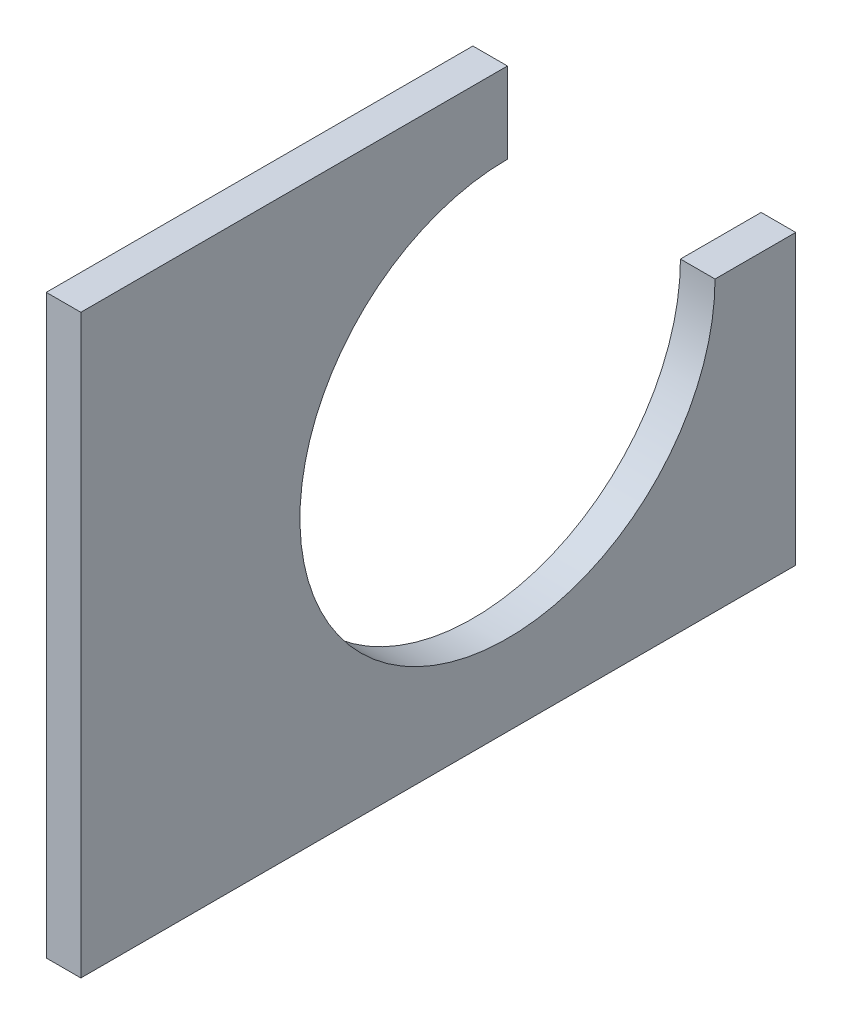
ISO-10303-21;
HEADER;
FILE_DESCRIPTION(('STEP AP214'),'2;1');
FILE_NAME('part.step','',(''),(''),'','','');
FILE_SCHEMA(('AUTOMOTIVE_DESIGN { 1 0 10303 214 1 1 1 1 }'));
ENDSEC;
DATA;
#1=APPLICATION_CONTEXT('core data for automotive mechanical design processes');
#2=APPLICATION_PROTOCOL_DEFINITION('international standard','automotive_design',2000,#1);
#3=PRODUCT_CONTEXT('',#1,'mechanical');
#4=PRODUCT('Part','Part','',(#3));
#5=PRODUCT_RELATED_PRODUCT_CATEGORY('part','',(#4));
#6=PRODUCT_DEFINITION_FORMATION('','',#4);
#7=PRODUCT_DEFINITION_CONTEXT('part definition',#1,'design');
#8=PRODUCT_DEFINITION('design','',#6,#7);
#9=PRODUCT_DEFINITION_SHAPE('','',#8);
#10=(LENGTH_UNIT() NAMED_UNIT(*) SI_UNIT(.MILLI.,.METRE.));
#11=(NAMED_UNIT(*) PLANE_ANGLE_UNIT() SI_UNIT($,.RADIAN.));
#12=(NAMED_UNIT(*) SI_UNIT($,.STERADIAN.) SOLID_ANGLE_UNIT());
#13=UNCERTAINTY_MEASURE_WITH_UNIT(LENGTH_MEASURE(1.E-05),#10,'distance_accuracy_value','');
#14=(GEOMETRIC_REPRESENTATION_CONTEXT(3) GLOBAL_UNCERTAINTY_ASSIGNED_CONTEXT((#13)) GLOBAL_UNIT_ASSIGNED_CONTEXT((#10,
#11,#12)) REPRESENTATION_CONTEXT('',''));
#15=CARTESIAN_POINT('',(0.,0.,0.));
#16=DIRECTION('',(0.,0.,1.));
#17=DIRECTION('',(1.,0.,0.));
#18=AXIS2_PLACEMENT_3D('',#15,#16,#17);
#19=CARTESIAN_POINT('',(3.,0.,0.));
#20=DIRECTION('',(-1.,0.,0.));
#21=DIRECTION('',(0.,0.,1.));
#22=AXIS2_PLACEMENT_3D('',#19,#20,#21);
#23=CYLINDRICAL_SURFACE('',#22,18.);
#24=CARTESIAN_POINT('',(0.,0.,0.));
#25=DIRECTION('',(-1.,0.,0.));
#26=DIRECTION('',(0.,0.,-1.));
#27=AXIS2_PLACEMENT_3D('',#24,#25,#26);
#28=CIRCLE('',#27,18.);
#29=CARTESIAN_POINT('',(0.,0.,-18.));
#30=VERTEX_POINT('',#29);
#31=CARTESIAN_POINT('',(0.,18.,0.));
#32=VERTEX_POINT('',#31);
#33=EDGE_CURVE('E123',#30,#32,#28,.T.);
#34=ORIENTED_EDGE('',*,*,#33,.T.);
#35=DIRECTION('',(-1.,0.,0.));
#36=VECTOR('',#35,1.);
#37=CARTESIAN_POINT('',(3.,18.,0.));
#38=LINE('',#37,#36);
#39=CARTESIAN_POINT('',(3.,18.,0.));
#40=VERTEX_POINT('',#39);
#41=EDGE_CURVE('E11',#40,#32,#38,.T.);
#42=ORIENTED_EDGE('',*,*,#41,.F.);
#43=CARTESIAN_POINT('',(3.,0.,0.));
#44=DIRECTION('',(-1.,0.,0.));
#45=DIRECTION('',(0.,0.,-1.));
#46=AXIS2_PLACEMENT_3D('',#43,#44,#45);
#47=CIRCLE('',#46,18.);
#48=CARTESIAN_POINT('',(3.,0.,-18.));
#49=VERTEX_POINT('',#48);
#50=EDGE_CURVE('E135',#49,#40,#47,.T.);
#51=ORIENTED_EDGE('',*,*,#50,.F.);
#52=DIRECTION('',(-1.,0.,0.));
#53=VECTOR('',#52,1.);
#54=CARTESIAN_POINT('',(3.,0.,-18.));
#55=LINE('',#54,#53);
#56=EDGE_CURVE('E119',#49,#30,#55,.T.);
#57=ORIENTED_EDGE('',*,*,#56,.T.);
#58=EDGE_LOOP('',(#34,#42,#51,#57));
#59=FACE_BOUND('',#58,.T.);
#60=ADVANCED_FACE('F33',(#59),#23,.F.);
#61=CARTESIAN_POINT('',(3.,25.,0.));
#62=DIRECTION('',(0.,0.,1.));
#63=DIRECTION('',(0.,-1.,0.));
#64=AXIS2_PLACEMENT_3D('',#61,#62,#63);
#65=PLANE('',#64);
#66=DIRECTION('',(0.,1.,0.));
#67=VECTOR('',#66,1.);
#68=CARTESIAN_POINT('',(0.,25.,0.));
#69=LINE('',#68,#67);
#70=CARTESIAN_POINT('',(0.,25.,0.));
#71=VERTEX_POINT('',#70);
#72=EDGE_CURVE('E126',#32,#71,#69,.T.);
#73=ORIENTED_EDGE('',*,*,#72,.T.);
#74=DIRECTION('',(-1.,0.,0.));
#75=VECTOR('',#74,1.);
#76=CARTESIAN_POINT('',(3.,25.,0.));
#77=LINE('',#76,#75);
#78=CARTESIAN_POINT('',(3.,25.,0.));
#79=VERTEX_POINT('',#78);
#80=EDGE_CURVE('E41',#79,#71,#77,.T.);
#81=ORIENTED_EDGE('',*,*,#80,.F.);
#82=DIRECTION('',(0.,1.,0.));
#83=VECTOR('',#82,1.);
#84=CARTESIAN_POINT('',(3.,25.,0.));
#85=LINE('',#84,#83);
#86=EDGE_CURVE('E89',#40,#79,#85,.T.);
#87=ORIENTED_EDGE('',*,*,#86,.F.);
#88=ORIENTED_EDGE('',*,*,#41,.T.);
#89=EDGE_LOOP('',(#73,#81,#87,#88));
#90=FACE_BOUND('',#89,.T.);
#91=ADVANCED_FACE('F160',(#90),#65,.F.);
#92=CARTESIAN_POINT('',(3.,25.,37.));
#93=DIRECTION('',(0.,-1.,0.));
#94=DIRECTION('',(0.,0.,-1.));
#95=AXIS2_PLACEMENT_3D('',#92,#93,#94);
#96=PLANE('',#95);
#97=DIRECTION('',(0.,0.,1.));
#98=VECTOR('',#97,1.);
#99=CARTESIAN_POINT('',(0.,25.,37.));
#100=LINE('',#99,#98);
#101=CARTESIAN_POINT('',(0.,25.,37.));
#102=VERTEX_POINT('',#101);
#103=EDGE_CURVE('E128',#71,#102,#100,.T.);
#104=ORIENTED_EDGE('',*,*,#103,.T.);
#105=DIRECTION('',(-1.,0.,0.));
#106=VECTOR('',#105,1.);
#107=CARTESIAN_POINT('',(3.,25.,37.));
#108=LINE('',#107,#106);
#109=CARTESIAN_POINT('',(3.,25.,37.));
#110=VERTEX_POINT('',#109);
#111=EDGE_CURVE('E139',#110,#102,#108,.T.);
#112=ORIENTED_EDGE('',*,*,#111,.F.);
#113=DIRECTION('',(0.,0.,1.));
#114=VECTOR('',#113,1.);
#115=CARTESIAN_POINT('',(3.,25.,37.));
#116=LINE('',#115,#114);
#117=EDGE_CURVE('E147',#79,#110,#116,.T.);
#118=ORIENTED_EDGE('',*,*,#117,.F.);
#119=ORIENTED_EDGE('',*,*,#80,.T.);
#120=EDGE_LOOP('',(#104,#112,#118,#119));
#121=FACE_BOUND('',#120,.T.);
#122=ADVANCED_FACE('F145',(#121),#96,.F.);
#123=CARTESIAN_POINT('',(3.,25.,37.));
#124=DIRECTION('',(0.,0.,-1.));
#125=DIRECTION('',(-1.,0.,0.));
#126=AXIS2_PLACEMENT_3D('',#123,#124,#125);
#127=PLANE('',#126);
#128=DIRECTION('',(0.,-1.,0.));
#129=VECTOR('',#128,1.);
#130=CARTESIAN_POINT('',(0.,25.,37.));
#131=LINE('',#130,#129);
#132=CARTESIAN_POINT('',(0.,-25.,37.));
#133=VERTEX_POINT('',#132);
#134=EDGE_CURVE('E130',#102,#133,#131,.T.);
#135=ORIENTED_EDGE('',*,*,#134,.T.);
#136=DIRECTION('',(-1.,0.,0.));
#137=VECTOR('',#136,1.);
#138=CARTESIAN_POINT('',(3.,-25.,37.));
#139=LINE('',#138,#137);
#140=CARTESIAN_POINT('',(3.,-25.,37.));
#141=VERTEX_POINT('',#140);
#142=EDGE_CURVE('E114',#141,#133,#139,.T.);
#143=ORIENTED_EDGE('',*,*,#142,.F.);
#144=DIRECTION('',(0.,-1.,0.));
#145=VECTOR('',#144,1.);
#146=CARTESIAN_POINT('',(3.,25.,37.));
#147=LINE('',#146,#145);
#148=EDGE_CURVE('E105',#110,#141,#147,.T.);
#149=ORIENTED_EDGE('',*,*,#148,.F.);
#150=ORIENTED_EDGE('',*,*,#111,.T.);
#151=EDGE_LOOP('',(#135,#143,#149,#150));
#152=FACE_BOUND('',#151,.T.);
#153=ADVANCED_FACE('F153',(#152),#127,.F.);
#154=CARTESIAN_POINT('',(3.,-25.,37.));
#155=DIRECTION('',(0.,1.,0.));
#156=DIRECTION('',(0.,0.,1.));
#157=AXIS2_PLACEMENT_3D('',#154,#155,#156);
#158=PLANE('',#157);
#159=DIRECTION('',(0.,0.,-1.));
#160=VECTOR('',#159,1.);
#161=CARTESIAN_POINT('',(0.,-25.,37.));
#162=LINE('',#161,#160);
#163=CARTESIAN_POINT('',(0.,-25.,-25.));
#164=VERTEX_POINT('',#163);
#165=EDGE_CURVE('E113',#133,#164,#162,.T.);
#166=ORIENTED_EDGE('',*,*,#165,.T.);
#167=DIRECTION('',(-1.,0.,0.));
#168=VECTOR('',#167,1.);
#169=CARTESIAN_POINT('',(3.,-25.,-25.));
#170=LINE('',#169,#168);
#171=CARTESIAN_POINT('',(3.,-25.,-25.));
#172=VERTEX_POINT('',#171);
#173=EDGE_CURVE('E110',#172,#164,#170,.T.);
#174=ORIENTED_EDGE('',*,*,#173,.F.);
#175=DIRECTION('',(0.,0.,-1.));
#176=VECTOR('',#175,1.);
#177=CARTESIAN_POINT('',(3.,-25.,37.));
#178=LINE('',#177,#176);
#179=EDGE_CURVE('E99',#141,#172,#178,.T.);
#180=ORIENTED_EDGE('',*,*,#179,.F.);
#181=ORIENTED_EDGE('',*,*,#142,.T.);
#182=EDGE_LOOP('',(#166,#174,#180,#181));
#183=FACE_BOUND('',#182,.T.);
#184=ADVANCED_FACE('F111',(#183),#158,.F.);
#185=CARTESIAN_POINT('',(3.,0.,-25.));
#186=DIRECTION('',(0.,0.,1.));
#187=DIRECTION('',(0.,-1.,0.));
#188=AXIS2_PLACEMENT_3D('',#185,#186,#187);
#189=PLANE('',#188);
#190=DIRECTION('',(0.,1.,0.));
#191=VECTOR('',#190,1.);
#192=CARTESIAN_POINT('',(0.,0.,-25.));
#193=LINE('',#192,#191);
#194=CARTESIAN_POINT('',(0.,0.,-25.));
#195=VERTEX_POINT('',#194);
#196=EDGE_CURVE('E75',#164,#195,#193,.T.);
#197=ORIENTED_EDGE('',*,*,#196,.T.);
#198=DIRECTION('',(-1.,0.,0.));
#199=VECTOR('',#198,1.);
#200=CARTESIAN_POINT('',(3.,0.,-25.));
#201=LINE('',#200,#199);
#202=CARTESIAN_POINT('',(3.,0.,-25.));
#203=VERTEX_POINT('',#202);
#204=EDGE_CURVE('E115',#203,#195,#201,.T.);
#205=ORIENTED_EDGE('',*,*,#204,.F.);
#206=DIRECTION('',(0.,1.,0.));
#207=VECTOR('',#206,1.);
#208=CARTESIAN_POINT('',(3.,0.,-25.));
#209=LINE('',#208,#207);
#210=EDGE_CURVE('E103',#172,#203,#209,.T.);
#211=ORIENTED_EDGE('',*,*,#210,.F.);
#212=ORIENTED_EDGE('',*,*,#173,.T.);
#213=EDGE_LOOP('',(#197,#205,#211,#212));
#214=FACE_BOUND('',#213,.T.);
#215=ADVANCED_FACE('F117',(#214),#189,.F.);
#216=CARTESIAN_POINT('',(3.,0.,-18.));
#217=DIRECTION('',(0.,-1.,0.));
#218=DIRECTION('',(0.,0.,-1.));
#219=AXIS2_PLACEMENT_3D('',#216,#217,#218);
#220=PLANE('',#219);
#221=DIRECTION('',(0.,0.,1.));
#222=VECTOR('',#221,1.);
#223=CARTESIAN_POINT('',(0.,0.,-18.));
#224=LINE('',#223,#222);
#225=EDGE_CURVE('E81',#195,#30,#224,.T.);
#226=ORIENTED_EDGE('',*,*,#225,.T.);
#227=ORIENTED_EDGE('',*,*,#56,.F.);
#228=DIRECTION('',(0.,0.,1.));
#229=VECTOR('',#228,1.);
#230=CARTESIAN_POINT('',(3.,0.,-18.));
#231=LINE('',#230,#229);
#232=EDGE_CURVE('E49',#203,#49,#231,.T.);
#233=ORIENTED_EDGE('',*,*,#232,.F.);
#234=ORIENTED_EDGE('',*,*,#204,.T.);
#235=EDGE_LOOP('',(#226,#227,#233,#234));
#236=FACE_BOUND('',#235,.T.);
#237=ADVANCED_FACE('F174',(#236),#220,.F.);
#238=CARTESIAN_POINT('',(3.,0.,0.));
#239=DIRECTION('',(1.,0.,0.));
#240=DIRECTION('',(0.,0.,-1.));
#241=AXIS2_PLACEMENT_3D('',#238,#239,#240);
#242=PLANE('',#241);
#243=ORIENTED_EDGE('',*,*,#50,.T.);
#244=ORIENTED_EDGE('',*,*,#86,.T.);
#245=ORIENTED_EDGE('',*,*,#117,.T.);
#246=ORIENTED_EDGE('',*,*,#148,.T.);
#247=ORIENTED_EDGE('',*,*,#179,.T.);
#248=ORIENTED_EDGE('',*,*,#210,.T.);
#249=ORIENTED_EDGE('',*,*,#232,.T.);
#250=EDGE_LOOP('',(#243,#244,#245,#246,#247,#248,#249));
#251=FACE_BOUND('',#250,.T.);
#252=ADVANCED_FACE('F101',(#251),#242,.T.);
#253=CARTESIAN_POINT('',(0.,0.,0.));
#254=DIRECTION('',(1.,0.,0.));
#255=DIRECTION('',(0.,0.,-1.));
#256=AXIS2_PLACEMENT_3D('',#253,#254,#255);
#257=PLANE('',#256);
#258=ORIENTED_EDGE('',*,*,#33,.F.);
#259=ORIENTED_EDGE('',*,*,#225,.F.);
#260=ORIENTED_EDGE('',*,*,#196,.F.);
#261=ORIENTED_EDGE('',*,*,#165,.F.);
#262=ORIENTED_EDGE('',*,*,#134,.F.);
#263=ORIENTED_EDGE('',*,*,#103,.F.);
#264=ORIENTED_EDGE('',*,*,#72,.F.);
#265=EDGE_LOOP('',(#258,#259,#260,#261,#262,#263,#264));
#266=FACE_BOUND('',#265,.T.);
#267=ADVANCED_FACE('F151',(#266),#257,.F.);
#268=CLOSED_SHELL('',(#60,#91,#122,#153,#184,#215,#237,#252,#267));
#269=MANIFOLD_SOLID_BREP('B2',#268);
#270=ADVANCED_BREP_SHAPE_REPRESENTATION('',(#18,#269),#14);
#271=SHAPE_DEFINITION_REPRESENTATION(#9,#270);
ENDSEC;
END-ISO-10303-21;
